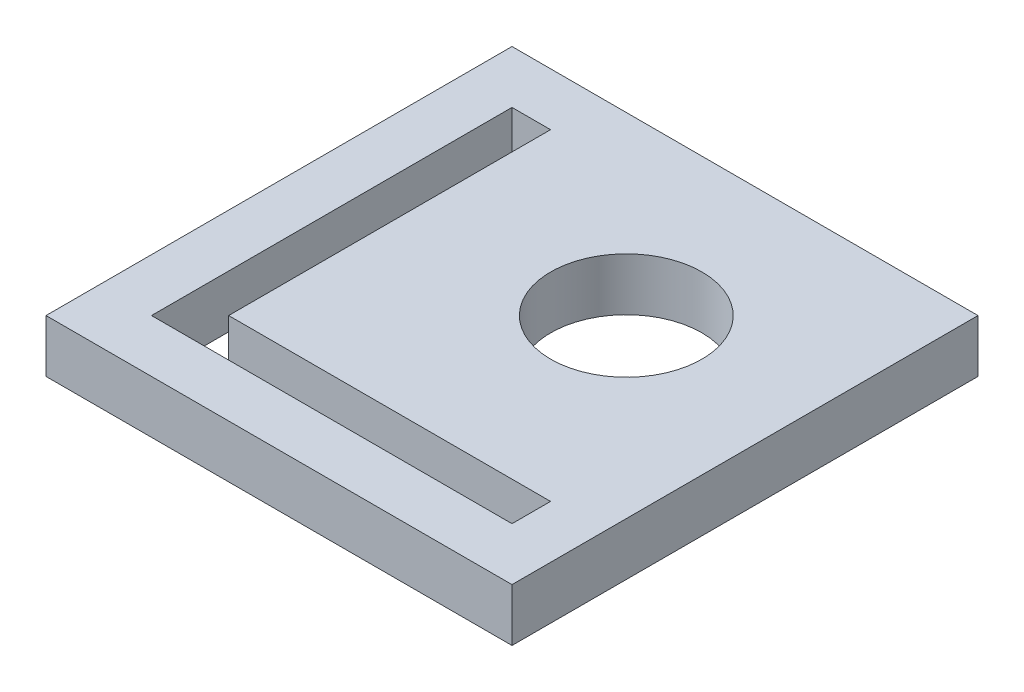
ISO-10303-21;
HEADER;
FILE_DESCRIPTION(('STEP AP214'),'2;1');
FILE_NAME('part.step','',(''),(''),'','','');
FILE_SCHEMA(('AUTOMOTIVE_DESIGN { 1 0 10303 214 1 1 1 1 }'));
ENDSEC;
DATA;
#1=APPLICATION_CONTEXT('core data for automotive mechanical design processes');
#2=APPLICATION_PROTOCOL_DEFINITION('international standard','automotive_design',2000,#1);
#3=PRODUCT_CONTEXT('',#1,'mechanical');
#4=PRODUCT('Part','Part','',(#3));
#5=PRODUCT_RELATED_PRODUCT_CATEGORY('part','',(#4));
#6=PRODUCT_DEFINITION_FORMATION('','',#4);
#7=PRODUCT_DEFINITION_CONTEXT('part definition',#1,'design');
#8=PRODUCT_DEFINITION('design','',#6,#7);
#9=PRODUCT_DEFINITION_SHAPE('','',#8);
#10=(LENGTH_UNIT() NAMED_UNIT(*) SI_UNIT(.MILLI.,.METRE.));
#11=(NAMED_UNIT(*) PLANE_ANGLE_UNIT() SI_UNIT($,.RADIAN.));
#12=(NAMED_UNIT(*) SI_UNIT($,.STERADIAN.) SOLID_ANGLE_UNIT());
#13=UNCERTAINTY_MEASURE_WITH_UNIT(LENGTH_MEASURE(1.E-05),#10,'distance_accuracy_value','');
#14=(GEOMETRIC_REPRESENTATION_CONTEXT(3) GLOBAL_UNCERTAINTY_ASSIGNED_CONTEXT((#13)) GLOBAL_UNIT_ASSIGNED_CONTEXT((#10,
#11,#12)) REPRESENTATION_CONTEXT('',''));
#15=CARTESIAN_POINT('',(0.,0.,0.));
#16=DIRECTION('',(0.,0.,1.));
#17=DIRECTION('',(1.,0.,0.));
#18=AXIS2_PLACEMENT_3D('',#15,#16,#17);
#19=CARTESIAN_POINT('',(0.,3.,0.));
#20=DIRECTION('',(0.,-1.,0.));
#21=DIRECTION('',(0.,0.,-1.));
#22=AXIS2_PLACEMENT_3D('',#19,#20,#21);
#23=PLANE('',#22);
#24=CARTESIAN_POINT('',(16.5,3.,-16.5));
#25=DIRECTION('',(0.,1.,0.));
#26=DIRECTION('',(0.,0.,1.));
#27=AXIS2_PLACEMENT_3D('',#24,#25,#26);
#28=CIRCLE('',#27,4.3);
#29=CARTESIAN_POINT('',(16.5,3.,-12.2));
#30=VERTEX_POINT('',#29);
#31=EDGE_CURVE('E259',#30,#30,#28,.T.);
#32=ORIENTED_EDGE('',*,*,#31,.F.);
#33=EDGE_LOOP('',(#32));
#34=FACE_BOUND('',#33,.T.);
#35=DIRECTION('',(0.,0.,1.));
#36=VECTOR('',#35,1.);
#37=CARTESIAN_POINT('',(0.,3.,0.));
#38=LINE('',#37,#36);
#39=CARTESIAN_POINT('',(0.,3.,-26.5));
#40=VERTEX_POINT('',#39);
#41=CARTESIAN_POINT('',(0.,3.,0.));
#42=VERTEX_POINT('',#41);
#43=EDGE_CURVE('E163',#40,#42,#38,.T.);
#44=ORIENTED_EDGE('',*,*,#43,.T.);
#45=DIRECTION('',(1.,0.,0.));
#46=VECTOR('',#45,1.);
#47=CARTESIAN_POINT('',(0.,3.,0.));
#48=LINE('',#47,#46);
#49=CARTESIAN_POINT('',(26.5,3.,0.));
#50=VERTEX_POINT('',#49);
#51=EDGE_CURVE('E166',#42,#50,#48,.T.);
#52=ORIENTED_EDGE('',*,*,#51,.T.);
#53=DIRECTION('',(0.,0.,-1.));
#54=VECTOR('',#53,1.);
#55=CARTESIAN_POINT('',(26.5,3.,0.));
#56=LINE('',#55,#54);
#57=CARTESIAN_POINT('',(26.5,3.,-26.5));
#58=VERTEX_POINT('',#57);
#59=EDGE_CURVE('E169',#50,#58,#56,.T.);
#60=ORIENTED_EDGE('',*,*,#59,.T.);
#61=DIRECTION('',(-1.,0.,0.));
#62=VECTOR('',#61,1.);
#63=CARTESIAN_POINT('',(0.,3.,-26.5));
#64=LINE('',#63,#62);
#65=EDGE_CURVE('E171',#58,#40,#64,.T.);
#66=ORIENTED_EDGE('',*,*,#65,.T.);
#67=EDGE_LOOP('',(#44,#52,#60,#66));
#68=FACE_BOUND('',#67,.T.);
#69=DIRECTION('',(-1.,0.,0.));
#70=VECTOR('',#69,1.);
#71=CARTESIAN_POINT('',(5.1933835,3.,-23.5));
#72=LINE('',#71,#70);
#73=CARTESIAN_POINT('',(5.1933835,3.,-23.5));
#74=VERTEX_POINT('',#73);
#75=CARTESIAN_POINT('',(3.,3.,-23.5));
#76=VERTEX_POINT('',#75);
#77=EDGE_CURVE('E110',#74,#76,#72,.T.);
#78=ORIENTED_EDGE('',*,*,#77,.F.);
#79=DIRECTION('',(0.,0.,-1.));
#80=VECTOR('',#79,1.);
#81=CARTESIAN_POINT('',(5.1933835,3.,-5.1933835));
#82=LINE('',#81,#80);
#83=CARTESIAN_POINT('',(5.1933835,3.,-5.1933835));
#84=VERTEX_POINT('',#83);
#85=EDGE_CURVE('E140',#84,#74,#82,.T.);
#86=ORIENTED_EDGE('',*,*,#85,.F.);
#87=DIRECTION('',(-1.,0.,0.));
#88=VECTOR('',#87,1.);
#89=CARTESIAN_POINT('',(23.5,3.,-5.1933835));
#90=LINE('',#89,#88);
#91=CARTESIAN_POINT('',(23.5,3.,-5.1933835));
#92=VERTEX_POINT('',#91);
#93=EDGE_CURVE('E138',#92,#84,#90,.T.);
#94=ORIENTED_EDGE('',*,*,#93,.F.);
#95=DIRECTION('',(0.,0.,-1.));
#96=VECTOR('',#95,1.);
#97=CARTESIAN_POINT('',(23.5,3.,-3.));
#98=LINE('',#97,#96);
#99=CARTESIAN_POINT('',(23.5,3.,-3.));
#100=VERTEX_POINT('',#99);
#101=EDGE_CURVE('E133',#100,#92,#98,.T.);
#102=ORIENTED_EDGE('',*,*,#101,.F.);
#103=DIRECTION('',(1.,0.,0.));
#104=VECTOR('',#103,1.);
#105=CARTESIAN_POINT('',(3.,3.,-3.));
#106=LINE('',#105,#104);
#107=CARTESIAN_POINT('',(3.,3.,-3.));
#108=VERTEX_POINT('',#107);
#109=EDGE_CURVE('E131',#108,#100,#106,.T.);
#110=ORIENTED_EDGE('',*,*,#109,.F.);
#111=DIRECTION('',(0.,0.,1.));
#112=VECTOR('',#111,1.);
#113=CARTESIAN_POINT('',(3.,3.,-23.5));
#114=LINE('',#113,#112);
#115=EDGE_CURVE('E118',#76,#108,#114,.T.);
#116=ORIENTED_EDGE('',*,*,#115,.F.);
#117=EDGE_LOOP('',(#78,#86,#94,#102,#110,#116));
#118=FACE_BOUND('',#117,.T.);
#119=ADVANCED_FACE('F33',(#34,#68,#118),#23,.F.);
#120=CARTESIAN_POINT('',(0.,0.,0.));
#121=DIRECTION('',(0.,-1.,0.));
#122=DIRECTION('',(0.,0.,-1.));
#123=AXIS2_PLACEMENT_3D('',#120,#121,#122);
#124=PLANE('',#123);
#125=CARTESIAN_POINT('',(16.5,0.,-16.5));
#126=DIRECTION('',(0.,1.,0.));
#127=DIRECTION('',(0.,0.,1.));
#128=AXIS2_PLACEMENT_3D('',#125,#126,#127);
#129=CIRCLE('',#128,4.3);
#130=CARTESIAN_POINT('',(16.5,0.,-12.2));
#131=VERTEX_POINT('',#130);
#132=EDGE_CURVE('E143',#131,#131,#129,.T.);
#133=ORIENTED_EDGE('',*,*,#132,.T.);
#134=EDGE_LOOP('',(#133));
#135=FACE_BOUND('',#134,.T.);
#136=DIRECTION('',(0.,0.,1.));
#137=VECTOR('',#136,1.);
#138=CARTESIAN_POINT('',(0.,0.,0.));
#139=LINE('',#138,#137);
#140=CARTESIAN_POINT('',(0.,0.,-26.5));
#141=VERTEX_POINT('',#140);
#142=CARTESIAN_POINT('',(0.,0.,0.));
#143=VERTEX_POINT('',#142);
#144=EDGE_CURVE('E126',#141,#143,#139,.T.);
#145=ORIENTED_EDGE('',*,*,#144,.F.);
#146=DIRECTION('',(-1.,0.,0.));
#147=VECTOR('',#146,1.);
#148=CARTESIAN_POINT('',(0.,0.,-26.5));
#149=LINE('',#148,#147);
#150=CARTESIAN_POINT('',(26.5,0.,-26.5));
#151=VERTEX_POINT('',#150);
#152=EDGE_CURVE('E167',#151,#141,#149,.T.);
#153=ORIENTED_EDGE('',*,*,#152,.F.);
#154=DIRECTION('',(0.,0.,-1.));
#155=VECTOR('',#154,1.);
#156=CARTESIAN_POINT('',(26.5,0.,0.));
#157=LINE('',#156,#155);
#158=CARTESIAN_POINT('',(26.5,0.,0.));
#159=VERTEX_POINT('',#158);
#160=EDGE_CURVE('E178',#159,#151,#157,.T.);
#161=ORIENTED_EDGE('',*,*,#160,.F.);
#162=DIRECTION('',(1.,0.,0.));
#163=VECTOR('',#162,1.);
#164=CARTESIAN_POINT('',(0.,0.,0.));
#165=LINE('',#164,#163);
#166=EDGE_CURVE('E176',#143,#159,#165,.T.);
#167=ORIENTED_EDGE('',*,*,#166,.F.);
#168=EDGE_LOOP('',(#145,#153,#161,#167));
#169=FACE_BOUND('',#168,.T.);
#170=DIRECTION('',(0.,0.,-1.));
#171=VECTOR('',#170,1.);
#172=CARTESIAN_POINT('',(5.1933835,0.,-5.1933835));
#173=LINE('',#172,#171);
#174=CARTESIAN_POINT('',(5.1933835,0.,-5.1933835));
#175=VERTEX_POINT('',#174);
#176=CARTESIAN_POINT('',(5.1933835,0.,-23.5));
#177=VERTEX_POINT('',#176);
#178=EDGE_CURVE('E119',#175,#177,#173,.T.);
#179=ORIENTED_EDGE('',*,*,#178,.T.);
#180=DIRECTION('',(-1.,0.,0.));
#181=VECTOR('',#180,1.);
#182=CARTESIAN_POINT('',(5.1933835,0.,-23.5));
#183=LINE('',#182,#181);
#184=CARTESIAN_POINT('',(3.,0.,-23.5));
#185=VERTEX_POINT('',#184);
#186=EDGE_CURVE('E56',#177,#185,#183,.T.);
#187=ORIENTED_EDGE('',*,*,#186,.T.);
#188=DIRECTION('',(0.,0.,1.));
#189=VECTOR('',#188,1.);
#190=CARTESIAN_POINT('',(3.,0.,-23.5));
#191=LINE('',#190,#189);
#192=CARTESIAN_POINT('',(3.,0.,-3.));
#193=VERTEX_POINT('',#192);
#194=EDGE_CURVE('E125',#185,#193,#191,.T.);
#195=ORIENTED_EDGE('',*,*,#194,.T.);
#196=DIRECTION('',(1.,0.,0.));
#197=VECTOR('',#196,1.);
#198=CARTESIAN_POINT('',(3.,0.,-3.));
#199=LINE('',#198,#197);
#200=CARTESIAN_POINT('',(23.5,0.,-3.));
#201=VERTEX_POINT('',#200);
#202=EDGE_CURVE('E145',#193,#201,#199,.T.);
#203=ORIENTED_EDGE('',*,*,#202,.T.);
#204=DIRECTION('',(0.,0.,-1.));
#205=VECTOR('',#204,1.);
#206=CARTESIAN_POINT('',(23.5,0.,-3.));
#207=LINE('',#206,#205);
#208=CARTESIAN_POINT('',(23.5,0.,-5.1933835));
#209=VERTEX_POINT('',#208);
#210=EDGE_CURVE('E148',#201,#209,#207,.T.);
#211=ORIENTED_EDGE('',*,*,#210,.T.);
#212=DIRECTION('',(-1.,0.,0.));
#213=VECTOR('',#212,1.);
#214=CARTESIAN_POINT('',(23.5,0.,-5.1933835));
#215=LINE('',#214,#213);
#216=EDGE_CURVE('E151',#209,#175,#215,.T.);
#217=ORIENTED_EDGE('',*,*,#216,.T.);
#218=EDGE_LOOP('',(#179,#187,#195,#203,#211,#217));
#219=FACE_BOUND('',#218,.T.);
#220=ADVANCED_FACE('F196',(#135,#169,#219),#124,.T.);
#221=CARTESIAN_POINT('',(0.,3.,0.));
#222=DIRECTION('',(1.,0.,0.));
#223=DIRECTION('',(0.,0.,-1.));
#224=AXIS2_PLACEMENT_3D('',#221,#222,#223);
#225=PLANE('',#224);
#226=ORIENTED_EDGE('',*,*,#144,.T.);
#227=DIRECTION('',(0.,-1.,0.));
#228=VECTOR('',#227,1.);
#229=CARTESIAN_POINT('',(0.,3.,0.));
#230=LINE('',#229,#228);
#231=EDGE_CURVE('E11',#42,#143,#230,.T.);
#232=ORIENTED_EDGE('',*,*,#231,.F.);
#233=ORIENTED_EDGE('',*,*,#43,.F.);
#234=DIRECTION('',(0.,-1.,0.));
#235=VECTOR('',#234,1.);
#236=CARTESIAN_POINT('',(0.,3.,-26.5));
#237=LINE('',#236,#235);
#238=EDGE_CURVE('E173',#40,#141,#237,.T.);
#239=ORIENTED_EDGE('',*,*,#238,.T.);
#240=EDGE_LOOP('',(#226,#232,#233,#239));
#241=FACE_BOUND('',#240,.T.);
#242=ADVANCED_FACE('F35',(#241),#225,.F.);
#243=CARTESIAN_POINT('',(0.,3.,0.));
#244=DIRECTION('',(0.,0.,-1.));
#245=DIRECTION('',(-1.,0.,0.));
#246=AXIS2_PLACEMENT_3D('',#243,#244,#245);
#247=PLANE('',#246);
#248=ORIENTED_EDGE('',*,*,#166,.T.);
#249=DIRECTION('',(0.,-1.,0.));
#250=VECTOR('',#249,1.);
#251=CARTESIAN_POINT('',(26.5,3.,0.));
#252=LINE('',#251,#250);
#253=EDGE_CURVE('E41',#50,#159,#252,.T.);
#254=ORIENTED_EDGE('',*,*,#253,.F.);
#255=ORIENTED_EDGE('',*,*,#51,.F.);
#256=ORIENTED_EDGE('',*,*,#231,.T.);
#257=EDGE_LOOP('',(#248,#254,#255,#256));
#258=FACE_BOUND('',#257,.T.);
#259=ADVANCED_FACE('F206',(#258),#247,.F.);
#260=CARTESIAN_POINT('',(26.5,3.,0.));
#261=DIRECTION('',(-1.,0.,0.));
#262=DIRECTION('',(0.,0.,1.));
#263=AXIS2_PLACEMENT_3D('',#260,#261,#262);
#264=PLANE('',#263);
#265=ORIENTED_EDGE('',*,*,#160,.T.);
#266=DIRECTION('',(0.,-1.,0.));
#267=VECTOR('',#266,1.);
#268=CARTESIAN_POINT('',(26.5,3.,-26.5));
#269=LINE('',#268,#267);
#270=EDGE_CURVE('E183',#58,#151,#269,.T.);
#271=ORIENTED_EDGE('',*,*,#270,.F.);
#272=ORIENTED_EDGE('',*,*,#59,.F.);
#273=ORIENTED_EDGE('',*,*,#253,.T.);
#274=EDGE_LOOP('',(#265,#271,#272,#273));
#275=FACE_BOUND('',#274,.T.);
#276=ADVANCED_FACE('F190',(#275),#264,.F.);
#277=CARTESIAN_POINT('',(0.,3.,-26.5));
#278=DIRECTION('',(0.,0.,1.));
#279=DIRECTION('',(1.,0.,0.));
#280=AXIS2_PLACEMENT_3D('',#277,#278,#279);
#281=PLANE('',#280);
#282=ORIENTED_EDGE('',*,*,#152,.T.);
#283=ORIENTED_EDGE('',*,*,#238,.F.);
#284=ORIENTED_EDGE('',*,*,#65,.F.);
#285=ORIENTED_EDGE('',*,*,#270,.T.);
#286=EDGE_LOOP('',(#282,#283,#284,#285));
#287=FACE_BOUND('',#286,.T.);
#288=ADVANCED_FACE('F200',(#287),#281,.F.);
#289=CARTESIAN_POINT('',(5.1933835,3.,-23.5));
#290=DIRECTION('',(0.,0.,1.));
#291=DIRECTION('',(1.,0.,0.));
#292=AXIS2_PLACEMENT_3D('',#289,#290,#291);
#293=PLANE('',#292);
#294=ORIENTED_EDGE('',*,*,#186,.F.);
#295=DIRECTION('',(0.,-1.,0.));
#296=VECTOR('',#295,1.);
#297=CARTESIAN_POINT('',(5.1933835,3.,-23.5));
#298=LINE('',#297,#296);
#299=EDGE_CURVE('E114',#74,#177,#298,.T.);
#300=ORIENTED_EDGE('',*,*,#299,.F.);
#301=ORIENTED_EDGE('',*,*,#77,.T.);
#302=DIRECTION('',(0.,-1.,0.));
#303=VECTOR('',#302,1.);
#304=CARTESIAN_POINT('',(3.,3.,-23.5));
#305=LINE('',#304,#303);
#306=EDGE_CURVE('E113',#76,#185,#305,.T.);
#307=ORIENTED_EDGE('',*,*,#306,.T.);
#308=EDGE_LOOP('',(#294,#300,#301,#307));
#309=FACE_BOUND('',#308,.T.);
#310=ADVANCED_FACE('F112',(#309),#293,.T.);
#311=CARTESIAN_POINT('',(3.,3.,-23.5));
#312=DIRECTION('',(1.,0.,0.));
#313=DIRECTION('',(0.,0.,-1.));
#314=AXIS2_PLACEMENT_3D('',#311,#312,#313);
#315=PLANE('',#314);
#316=ORIENTED_EDGE('',*,*,#194,.F.);
#317=ORIENTED_EDGE('',*,*,#306,.F.);
#318=ORIENTED_EDGE('',*,*,#115,.T.);
#319=DIRECTION('',(0.,-1.,0.));
#320=VECTOR('',#319,1.);
#321=CARTESIAN_POINT('',(3.,3.,-3.));
#322=LINE('',#321,#320);
#323=EDGE_CURVE('E127',#108,#193,#322,.T.);
#324=ORIENTED_EDGE('',*,*,#323,.T.);
#325=EDGE_LOOP('',(#316,#317,#318,#324));
#326=FACE_BOUND('',#325,.T.);
#327=ADVANCED_FACE('F122',(#326),#315,.T.);
#328=CARTESIAN_POINT('',(3.,3.,-3.));
#329=DIRECTION('',(0.,0.,-1.));
#330=DIRECTION('',(-1.,0.,0.));
#331=AXIS2_PLACEMENT_3D('',#328,#329,#330);
#332=PLANE('',#331);
#333=ORIENTED_EDGE('',*,*,#202,.F.);
#334=ORIENTED_EDGE('',*,*,#323,.F.);
#335=ORIENTED_EDGE('',*,*,#109,.T.);
#336=DIRECTION('',(0.,-1.,0.));
#337=VECTOR('',#336,1.);
#338=CARTESIAN_POINT('',(23.5,3.,-3.));
#339=LINE('',#338,#337);
#340=EDGE_CURVE('E160',#100,#201,#339,.T.);
#341=ORIENTED_EDGE('',*,*,#340,.T.);
#342=EDGE_LOOP('',(#333,#334,#335,#341));
#343=FACE_BOUND('',#342,.T.);
#344=ADVANCED_FACE('F232',(#343),#332,.T.);
#345=CARTESIAN_POINT('',(23.5,3.,-3.));
#346=DIRECTION('',(-1.,0.,0.));
#347=DIRECTION('',(0.,0.,1.));
#348=AXIS2_PLACEMENT_3D('',#345,#346,#347);
#349=PLANE('',#348);
#350=ORIENTED_EDGE('',*,*,#210,.F.);
#351=ORIENTED_EDGE('',*,*,#340,.F.);
#352=ORIENTED_EDGE('',*,*,#101,.T.);
#353=DIRECTION('',(0.,-1.,0.));
#354=VECTOR('',#353,1.);
#355=CARTESIAN_POINT('',(23.5,3.,-5.1933835));
#356=LINE('',#355,#354);
#357=EDGE_CURVE('E158',#92,#209,#356,.T.);
#358=ORIENTED_EDGE('',*,*,#357,.T.);
#359=EDGE_LOOP('',(#350,#351,#352,#358));
#360=FACE_BOUND('',#359,.T.);
#361=ADVANCED_FACE('F236',(#360),#349,.T.);
#362=CARTESIAN_POINT('',(23.5,3.,-5.1933835));
#363=DIRECTION('',(0.,0.,1.));
#364=DIRECTION('',(1.,0.,0.));
#365=AXIS2_PLACEMENT_3D('',#362,#363,#364);
#366=PLANE('',#365);
#367=ORIENTED_EDGE('',*,*,#216,.F.);
#368=ORIENTED_EDGE('',*,*,#357,.F.);
#369=ORIENTED_EDGE('',*,*,#93,.T.);
#370=DIRECTION('',(0.,-1.,0.));
#371=VECTOR('',#370,1.);
#372=CARTESIAN_POINT('',(5.1933835,3.,-5.1933835));
#373=LINE('',#372,#371);
#374=EDGE_CURVE('E48',#84,#175,#373,.T.);
#375=ORIENTED_EDGE('',*,*,#374,.T.);
#376=EDGE_LOOP('',(#367,#368,#369,#375));
#377=FACE_BOUND('',#376,.T.);
#378=ADVANCED_FACE('F242',(#377),#366,.T.);
#379=CARTESIAN_POINT('',(5.1933835,3.,-5.1933835));
#380=DIRECTION('',(-1.,0.,0.));
#381=DIRECTION('',(0.,0.,1.));
#382=AXIS2_PLACEMENT_3D('',#379,#380,#381);
#383=PLANE('',#382);
#384=ORIENTED_EDGE('',*,*,#178,.F.);
#385=ORIENTED_EDGE('',*,*,#374,.F.);
#386=ORIENTED_EDGE('',*,*,#85,.T.);
#387=ORIENTED_EDGE('',*,*,#299,.T.);
#388=EDGE_LOOP('',(#384,#385,#386,#387));
#389=FACE_BOUND('',#388,.T.);
#390=ADVANCED_FACE('F246',(#389),#383,.T.);
#391=CARTESIAN_POINT('',(16.5,0.,-16.5));
#392=DIRECTION('',(0.,1.,0.));
#393=DIRECTION('',(0.,0.,1.));
#394=AXIS2_PLACEMENT_3D('',#391,#392,#393);
#395=CYLINDRICAL_SURFACE('',#394,4.3);
#396=ORIENTED_EDGE('',*,*,#132,.F.);
#397=EDGE_LOOP('',(#396));
#398=FACE_BOUND('',#397,.T.);
#399=ORIENTED_EDGE('',*,*,#31,.T.);
#400=EDGE_LOOP('',(#399));
#401=FACE_BOUND('',#400,.T.);
#402=ADVANCED_FACE('F250',(#398,#401),#395,.F.);
#403=CLOSED_SHELL('',(#119,#220,#242,#259,#276,#288,#310,#327,#344,#361,#378,#390,#402));
#404=MANIFOLD_SOLID_BREP('B2',#403);
#405=ADVANCED_BREP_SHAPE_REPRESENTATION('',(#18,#404),#14);
#406=SHAPE_DEFINITION_REPRESENTATION(#9,#405);
ENDSEC;
END-ISO-10303-21;
